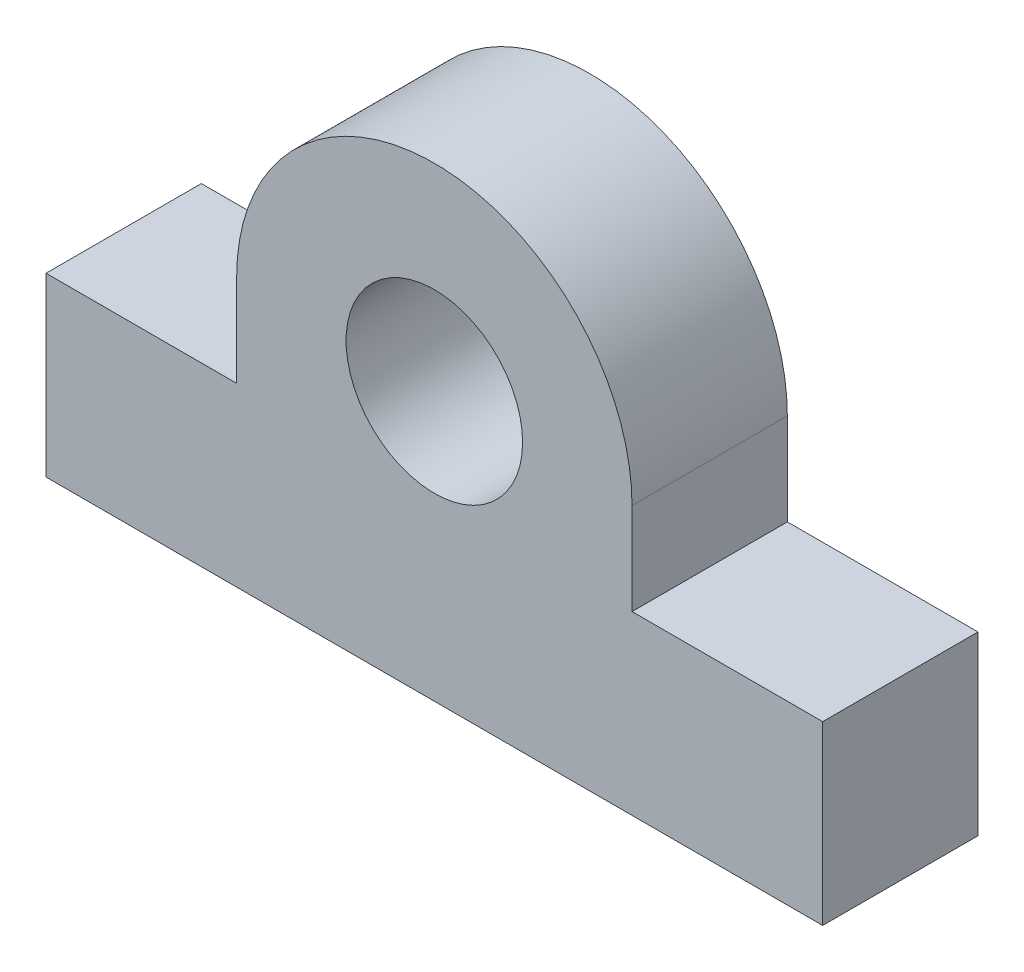
ISO-10303-21;
HEADER;
FILE_DESCRIPTION(('STEP AP214'),'2;1');
FILE_NAME('part.step','',(''),(''),'','','');
FILE_SCHEMA(('AUTOMOTIVE_DESIGN { 1 0 10303 214 1 1 1 1 }'));
ENDSEC;
DATA;
#1=APPLICATION_CONTEXT('core data for automotive mechanical design processes');
#2=APPLICATION_PROTOCOL_DEFINITION('international standard','automotive_design',2000,#1);
#3=PRODUCT_CONTEXT('',#1,'mechanical');
#4=PRODUCT('Part','Part','',(#3));
#5=PRODUCT_RELATED_PRODUCT_CATEGORY('part','',(#4));
#6=PRODUCT_DEFINITION_FORMATION('','',#4);
#7=PRODUCT_DEFINITION_CONTEXT('part definition',#1,'design');
#8=PRODUCT_DEFINITION('design','',#6,#7);
#9=PRODUCT_DEFINITION_SHAPE('','',#8);
#10=(LENGTH_UNIT() NAMED_UNIT(*) SI_UNIT(.MILLI.,.METRE.));
#11=(NAMED_UNIT(*) PLANE_ANGLE_UNIT() SI_UNIT($,.RADIAN.));
#12=(NAMED_UNIT(*) SI_UNIT($,.STERADIAN.) SOLID_ANGLE_UNIT());
#13=UNCERTAINTY_MEASURE_WITH_UNIT(LENGTH_MEASURE(1.E-05),#10,'distance_accuracy_value','');
#14=(GEOMETRIC_REPRESENTATION_CONTEXT(3) GLOBAL_UNCERTAINTY_ASSIGNED_CONTEXT((#13)) GLOBAL_UNIT_ASSIGNED_CONTEXT((#10,
#11,#12)) REPRESENTATION_CONTEXT('',''));
#15=CARTESIAN_POINT('',(0.,0.,0.));
#16=DIRECTION('',(0.,0.,1.));
#17=DIRECTION('',(1.,0.,0.));
#18=AXIS2_PLACEMENT_3D('',#15,#16,#17);
#19=CARTESIAN_POINT('',(0.,38.,11.));
#20=DIRECTION('',(0.,0.,-1.));
#21=DIRECTION('',(-1.,0.,0.));
#22=AXIS2_PLACEMENT_3D('',#19,#20,#21);
#23=PLANE('',#22);
#24=DIRECTION('',(0.,-1.,0.));
#25=VECTOR('',#24,1.);
#26=CARTESIAN_POINT('',(-55.,0.,11.));
#27=LINE('',#26,#25);
#28=CARTESIAN_POINT('',(-55.,25.,11.));
#29=VERTEX_POINT('',#28);
#30=CARTESIAN_POINT('',(-55.,0.,11.));
#31=VERTEX_POINT('',#30);
#32=EDGE_CURVE('E151',#29,#31,#27,.T.);
#33=ORIENTED_EDGE('',*,*,#32,.T.);
#34=DIRECTION('',(1.,0.,0.));
#35=VECTOR('',#34,1.);
#36=CARTESIAN_POINT('',(-55.,0.,11.));
#37=LINE('',#36,#35);
#38=CARTESIAN_POINT('',(55.,0.,11.));
#39=VERTEX_POINT('',#38);
#40=EDGE_CURVE('E97',#31,#39,#37,.T.);
#41=ORIENTED_EDGE('',*,*,#40,.T.);
#42=DIRECTION('',(0.,1.,0.));
#43=VECTOR('',#42,1.);
#44=CARTESIAN_POINT('',(55.,0.,11.));
#45=LINE('',#44,#43);
#46=CARTESIAN_POINT('',(55.,25.,11.));
#47=VERTEX_POINT('',#46);
#48=EDGE_CURVE('E167',#39,#47,#45,.T.);
#49=ORIENTED_EDGE('',*,*,#48,.T.);
#50=DIRECTION('',(-1.,0.,0.));
#51=VECTOR('',#50,1.);
#52=CARTESIAN_POINT('',(28.,25.,11.));
#53=LINE('',#52,#51);
#54=CARTESIAN_POINT('',(28.,25.,11.));
#55=VERTEX_POINT('',#54);
#56=EDGE_CURVE('E178',#47,#55,#53,.T.);
#57=ORIENTED_EDGE('',*,*,#56,.T.);
#58=DIRECTION('',(0.,1.,0.));
#59=VECTOR('',#58,1.);
#60=CARTESIAN_POINT('',(28.,25.,11.));
#61=LINE('',#60,#59);
#62=CARTESIAN_POINT('',(28.,38.,11.));
#63=VERTEX_POINT('',#62);
#64=EDGE_CURVE('E119',#55,#63,#61,.T.);
#65=ORIENTED_EDGE('',*,*,#64,.T.);
#66=CARTESIAN_POINT('',(0.,38.,11.));
#67=DIRECTION('',(0.,0.,1.));
#68=DIRECTION('',(-1.,0.,0.));
#69=AXIS2_PLACEMENT_3D('',#66,#67,#68);
#70=CIRCLE('',#69,28.);
#71=CARTESIAN_POINT('',(-28.,38.,11.));
#72=VERTEX_POINT('',#71);
#73=EDGE_CURVE('E115',#63,#72,#70,.T.);
#74=ORIENTED_EDGE('',*,*,#73,.T.);
#75=DIRECTION('',(0.,-1.,0.));
#76=VECTOR('',#75,1.);
#77=CARTESIAN_POINT('',(-28.,25.,11.));
#78=LINE('',#77,#76);
#79=CARTESIAN_POINT('',(-28.,25.,11.));
#80=VERTEX_POINT('',#79);
#81=EDGE_CURVE('E117',#72,#80,#78,.T.);
#82=ORIENTED_EDGE('',*,*,#81,.T.);
#83=DIRECTION('',(-1.,0.,0.));
#84=VECTOR('',#83,1.);
#85=CARTESIAN_POINT('',(-55.,25.,11.));
#86=LINE('',#85,#84);
#87=EDGE_CURVE('E57',#80,#29,#86,.T.);
#88=ORIENTED_EDGE('',*,*,#87,.T.);
#89=EDGE_LOOP('',(#33,#41,#49,#57,#65,#74,#82,#88));
#90=FACE_BOUND('',#89,.T.);
#91=CARTESIAN_POINT('',(0.,38.,11.));
#92=DIRECTION('',(0.,0.,1.));
#93=DIRECTION('',(1.,0.,0.));
#94=AXIS2_PLACEMENT_3D('',#91,#92,#93);
#95=CIRCLE('',#94,12.5);
#96=CARTESIAN_POINT('',(12.5,38.,11.));
#97=VERTEX_POINT('',#96);
#98=EDGE_CURVE('E139',#97,#97,#95,.T.);
#99=ORIENTED_EDGE('',*,*,#98,.F.);
#100=EDGE_LOOP('',(#99));
#101=FACE_BOUND('',#100,.T.);
#102=ADVANCED_FACE('F39',(#90,#101),#23,.F.);
#103=CARTESIAN_POINT('',(0.,38.,-11.));
#104=DIRECTION('',(0.,0.,-1.));
#105=DIRECTION('',(-1.,0.,0.));
#106=AXIS2_PLACEMENT_3D('',#103,#104,#105);
#107=PLANE('',#106);
#108=DIRECTION('',(0.,-1.,0.));
#109=VECTOR('',#108,1.);
#110=CARTESIAN_POINT('',(-55.,0.,-11.));
#111=LINE('',#110,#109);
#112=CARTESIAN_POINT('',(-55.,25.,-11.));
#113=VERTEX_POINT('',#112);
#114=CARTESIAN_POINT('',(-55.,0.,-11.));
#115=VERTEX_POINT('',#114);
#116=EDGE_CURVE('E136',#113,#115,#111,.T.);
#117=ORIENTED_EDGE('',*,*,#116,.F.);
#118=DIRECTION('',(-1.,0.,0.));
#119=VECTOR('',#118,1.);
#120=CARTESIAN_POINT('',(-55.,25.,-11.));
#121=LINE('',#120,#119);
#122=CARTESIAN_POINT('',(-28.,25.,-11.));
#123=VERTEX_POINT('',#122);
#124=EDGE_CURVE('E93',#123,#113,#121,.T.);
#125=ORIENTED_EDGE('',*,*,#124,.F.);
#126=DIRECTION('',(0.,-1.,0.));
#127=VECTOR('',#126,1.);
#128=CARTESIAN_POINT('',(-28.,25.,-11.));
#129=LINE('',#128,#127);
#130=CARTESIAN_POINT('',(-28.,38.,-11.));
#131=VERTEX_POINT('',#130);
#132=EDGE_CURVE('E84',#131,#123,#129,.T.);
#133=ORIENTED_EDGE('',*,*,#132,.F.);
#134=CARTESIAN_POINT('',(0.,38.,-11.));
#135=DIRECTION('',(0.,0.,1.));
#136=DIRECTION('',(-1.,0.,0.));
#137=AXIS2_PLACEMENT_3D('',#134,#135,#136);
#138=CIRCLE('',#137,28.);
#139=CARTESIAN_POINT('',(28.,38.,-11.));
#140=VERTEX_POINT('',#139);
#141=EDGE_CURVE('E127',#140,#131,#138,.T.);
#142=ORIENTED_EDGE('',*,*,#141,.F.);
#143=DIRECTION('',(0.,1.,0.));
#144=VECTOR('',#143,1.);
#145=CARTESIAN_POINT('',(28.,25.,-11.));
#146=LINE('',#145,#144);
#147=CARTESIAN_POINT('',(28.,25.,-11.));
#148=VERTEX_POINT('',#147);
#149=EDGE_CURVE('E148',#148,#140,#146,.T.);
#150=ORIENTED_EDGE('',*,*,#149,.F.);
#151=DIRECTION('',(-1.,0.,0.));
#152=VECTOR('',#151,1.);
#153=CARTESIAN_POINT('',(28.,25.,-11.));
#154=LINE('',#153,#152);
#155=CARTESIAN_POINT('',(55.,25.,-11.));
#156=VERTEX_POINT('',#155);
#157=EDGE_CURVE('E145',#156,#148,#154,.T.);
#158=ORIENTED_EDGE('',*,*,#157,.F.);
#159=DIRECTION('',(0.,1.,0.));
#160=VECTOR('',#159,1.);
#161=CARTESIAN_POINT('',(55.,0.,-11.));
#162=LINE('',#161,#160);
#163=CARTESIAN_POINT('',(55.,0.,-11.));
#164=VERTEX_POINT('',#163);
#165=EDGE_CURVE('E142',#164,#156,#162,.T.);
#166=ORIENTED_EDGE('',*,*,#165,.F.);
#167=DIRECTION('',(1.,0.,0.));
#168=VECTOR('',#167,1.);
#169=CARTESIAN_POINT('',(-55.,0.,-11.));
#170=LINE('',#169,#168);
#171=EDGE_CURVE('E138',#115,#164,#170,.T.);
#172=ORIENTED_EDGE('',*,*,#171,.F.);
#173=EDGE_LOOP('',(#117,#125,#133,#142,#150,#158,#166,#172));
#174=FACE_BOUND('',#173,.T.);
#175=CARTESIAN_POINT('',(0.,38.,-11.));
#176=DIRECTION('',(0.,0.,1.));
#177=DIRECTION('',(1.,0.,0.));
#178=AXIS2_PLACEMENT_3D('',#175,#176,#177);
#179=CIRCLE('',#178,12.5);
#180=CARTESIAN_POINT('',(12.5,38.,-11.));
#181=VERTEX_POINT('',#180);
#182=EDGE_CURVE('E183',#181,#181,#179,.T.);
#183=ORIENTED_EDGE('',*,*,#182,.T.);
#184=EDGE_LOOP('',(#183));
#185=FACE_BOUND('',#184,.T.);
#186=ADVANCED_FACE('F168',(#174,#185),#107,.T.);
#187=CARTESIAN_POINT('',(-55.,0.,11.));
#188=DIRECTION('',(1.,0.,0.));
#189=DIRECTION('',(0.,0.,-1.));
#190=AXIS2_PLACEMENT_3D('',#187,#188,#189);
#191=PLANE('',#190);
#192=ORIENTED_EDGE('',*,*,#116,.T.);
#193=DIRECTION('',(0.,0.,-1.));
#194=VECTOR('',#193,1.);
#195=CARTESIAN_POINT('',(-55.,0.,11.));
#196=LINE('',#195,#194);
#197=EDGE_CURVE('E11',#31,#115,#196,.T.);
#198=ORIENTED_EDGE('',*,*,#197,.F.);
#199=ORIENTED_EDGE('',*,*,#32,.F.);
#200=DIRECTION('',(0.,0.,-1.));
#201=VECTOR('',#200,1.);
#202=CARTESIAN_POINT('',(-55.,25.,11.));
#203=LINE('',#202,#201);
#204=EDGE_CURVE('E135',#29,#113,#203,.T.);
#205=ORIENTED_EDGE('',*,*,#204,.T.);
#206=EDGE_LOOP('',(#192,#198,#199,#205));
#207=FACE_BOUND('',#206,.T.);
#208=ADVANCED_FACE('F41',(#207),#191,.F.);
#209=CARTESIAN_POINT('',(-55.,0.,11.));
#210=DIRECTION('',(0.,1.,0.));
#211=DIRECTION('',(0.,0.,1.));
#212=AXIS2_PLACEMENT_3D('',#209,#210,#211);
#213=PLANE('',#212);
#214=ORIENTED_EDGE('',*,*,#171,.T.);
#215=DIRECTION('',(0.,0.,-1.));
#216=VECTOR('',#215,1.);
#217=CARTESIAN_POINT('',(55.,0.,11.));
#218=LINE('',#217,#216);
#219=EDGE_CURVE('E48',#39,#164,#218,.T.);
#220=ORIENTED_EDGE('',*,*,#219,.F.);
#221=ORIENTED_EDGE('',*,*,#40,.F.);
#222=ORIENTED_EDGE('',*,*,#197,.T.);
#223=EDGE_LOOP('',(#214,#220,#221,#222));
#224=FACE_BOUND('',#223,.T.);
#225=ADVANCED_FACE('F213',(#224),#213,.F.);
#226=CARTESIAN_POINT('',(55.,0.,11.));
#227=DIRECTION('',(-1.,0.,0.));
#228=DIRECTION('',(0.,-1.,0.));
#229=AXIS2_PLACEMENT_3D('',#226,#227,#228);
#230=PLANE('',#229);
#231=ORIENTED_EDGE('',*,*,#165,.T.);
#232=DIRECTION('',(0.,0.,-1.));
#233=VECTOR('',#232,1.);
#234=CARTESIAN_POINT('',(55.,25.,11.));
#235=LINE('',#234,#233);
#236=EDGE_CURVE('E158',#47,#156,#235,.T.);
#237=ORIENTED_EDGE('',*,*,#236,.F.);
#238=ORIENTED_EDGE('',*,*,#48,.F.);
#239=ORIENTED_EDGE('',*,*,#219,.T.);
#240=EDGE_LOOP('',(#231,#237,#238,#239));
#241=FACE_BOUND('',#240,.T.);
#242=ADVANCED_FACE('F163',(#241),#230,.F.);
#243=CARTESIAN_POINT('',(28.,25.,11.));
#244=DIRECTION('',(0.,-1.,0.));
#245=DIRECTION('',(1.,0.,0.));
#246=AXIS2_PLACEMENT_3D('',#243,#244,#245);
#247=PLANE('',#246);
#248=ORIENTED_EDGE('',*,*,#157,.T.);
#249=DIRECTION('',(0.,0.,-1.));
#250=VECTOR('',#249,1.);
#251=CARTESIAN_POINT('',(28.,25.,11.));
#252=LINE('',#251,#250);
#253=EDGE_CURVE('E154',#55,#148,#252,.T.);
#254=ORIENTED_EDGE('',*,*,#253,.F.);
#255=ORIENTED_EDGE('',*,*,#56,.F.);
#256=ORIENTED_EDGE('',*,*,#236,.T.);
#257=EDGE_LOOP('',(#248,#254,#255,#256));
#258=FACE_BOUND('',#257,.T.);
#259=ADVANCED_FACE('F173',(#258),#247,.F.);
#260=CARTESIAN_POINT('',(28.,25.,11.));
#261=DIRECTION('',(-1.,0.,0.));
#262=DIRECTION('',(0.,-1.,0.));
#263=AXIS2_PLACEMENT_3D('',#260,#261,#262);
#264=PLANE('',#263);
#265=ORIENTED_EDGE('',*,*,#149,.T.);
#266=DIRECTION('',(0.,0.,-1.));
#267=VECTOR('',#266,1.);
#268=CARTESIAN_POINT('',(28.,38.,11.));
#269=LINE('',#268,#267);
#270=EDGE_CURVE('E130',#63,#140,#269,.T.);
#271=ORIENTED_EDGE('',*,*,#270,.F.);
#272=ORIENTED_EDGE('',*,*,#64,.F.);
#273=ORIENTED_EDGE('',*,*,#253,.T.);
#274=EDGE_LOOP('',(#265,#271,#272,#273));
#275=FACE_BOUND('',#274,.T.);
#276=ADVANCED_FACE('F177',(#275),#264,.F.);
#277=CARTESIAN_POINT('',(0.,38.,11.));
#278=DIRECTION('',(0.,0.,-1.));
#279=DIRECTION('',(-1.,0.,0.));
#280=AXIS2_PLACEMENT_3D('',#277,#278,#279);
#281=CYLINDRICAL_SURFACE('',#280,28.);
#282=ORIENTED_EDGE('',*,*,#141,.T.);
#283=DIRECTION('',(0.,0.,-1.));
#284=VECTOR('',#283,1.);
#285=CARTESIAN_POINT('',(-28.,38.,11.));
#286=LINE('',#285,#284);
#287=EDGE_CURVE('E122',#72,#131,#286,.T.);
#288=ORIENTED_EDGE('',*,*,#287,.F.);
#289=ORIENTED_EDGE('',*,*,#73,.F.);
#290=ORIENTED_EDGE('',*,*,#270,.T.);
#291=EDGE_LOOP('',(#282,#288,#289,#290));
#292=FACE_BOUND('',#291,.T.);
#293=ADVANCED_FACE('F123',(#292),#281,.T.);
#294=CARTESIAN_POINT('',(-28.,25.,11.));
#295=DIRECTION('',(1.,0.,0.));
#296=DIRECTION('',(0.,1.,0.));
#297=AXIS2_PLACEMENT_3D('',#294,#295,#296);
#298=PLANE('',#297);
#299=ORIENTED_EDGE('',*,*,#132,.T.);
#300=DIRECTION('',(0.,0.,-1.));
#301=VECTOR('',#300,1.);
#302=CARTESIAN_POINT('',(-28.,25.,11.));
#303=LINE('',#302,#301);
#304=EDGE_CURVE('E126',#80,#123,#303,.T.);
#305=ORIENTED_EDGE('',*,*,#304,.F.);
#306=ORIENTED_EDGE('',*,*,#81,.F.);
#307=ORIENTED_EDGE('',*,*,#287,.T.);
#308=EDGE_LOOP('',(#299,#305,#306,#307));
#309=FACE_BOUND('',#308,.T.);
#310=ADVANCED_FACE('F128',(#309),#298,.F.);
#311=CARTESIAN_POINT('',(-55.,25.,11.));
#312=DIRECTION('',(0.,-1.,0.));
#313=DIRECTION('',(1.,0.,0.));
#314=AXIS2_PLACEMENT_3D('',#311,#312,#313);
#315=PLANE('',#314);
#316=ORIENTED_EDGE('',*,*,#124,.T.);
#317=ORIENTED_EDGE('',*,*,#204,.F.);
#318=ORIENTED_EDGE('',*,*,#87,.F.);
#319=ORIENTED_EDGE('',*,*,#304,.T.);
#320=EDGE_LOOP('',(#316,#317,#318,#319));
#321=FACE_BOUND('',#320,.T.);
#322=ADVANCED_FACE('F203',(#321),#315,.F.);
#323=CARTESIAN_POINT('',(0.,38.,11.));
#324=DIRECTION('',(0.,0.,-1.));
#325=DIRECTION('',(-1.,0.,0.));
#326=AXIS2_PLACEMENT_3D('',#323,#324,#325);
#327=CYLINDRICAL_SURFACE('',#326,12.5);
#328=ORIENTED_EDGE('',*,*,#98,.T.);
#329=EDGE_LOOP('',(#328));
#330=FACE_BOUND('',#329,.T.);
#331=ORIENTED_EDGE('',*,*,#182,.F.);
#332=EDGE_LOOP('',(#331));
#333=FACE_BOUND('',#332,.T.);
#334=ADVANCED_FACE('F191',(#330,#333),#327,.F.);
#335=CLOSED_SHELL('',(#102,#186,#208,#225,#242,#259,#276,#293,#310,#322,#334));
#336=MANIFOLD_SOLID_BREP('B2',#335);
#337=ADVANCED_BREP_SHAPE_REPRESENTATION('',(#18,#336),#14);
#338=SHAPE_DEFINITION_REPRESENTATION(#9,#337);
ENDSEC;
END-ISO-10303-21;
